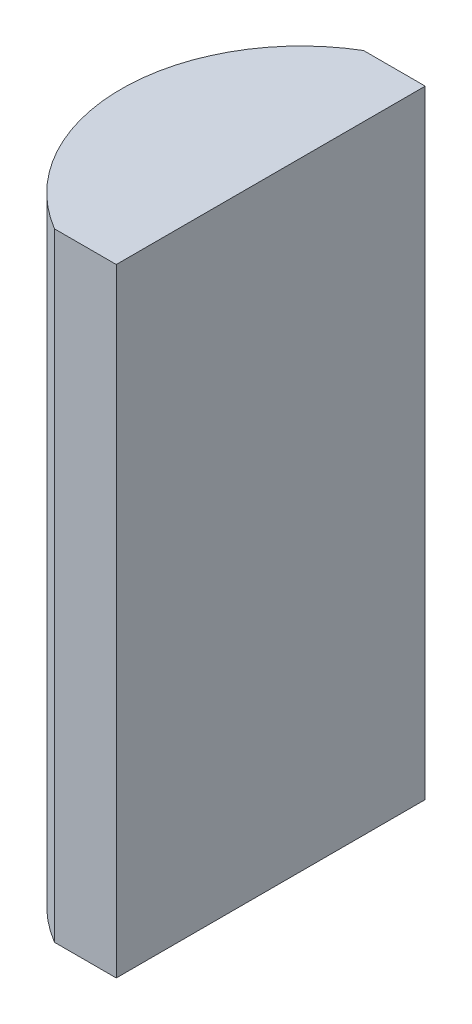
ISO-10303-21;
HEADER;
FILE_DESCRIPTION(('STEP AP214'),'2;1');
FILE_NAME('part.step','',(''),(''),'','','');
FILE_SCHEMA(('AUTOMOTIVE_DESIGN { 1 0 10303 214 1 1 1 1 }'));
ENDSEC;
DATA;
#1=APPLICATION_CONTEXT('core data for automotive mechanical design processes');
#2=APPLICATION_PROTOCOL_DEFINITION('international standard','automotive_design',2000,#1);
#3=PRODUCT_CONTEXT('',#1,'mechanical');
#4=PRODUCT('Part','Part','',(#3));
#5=PRODUCT_RELATED_PRODUCT_CATEGORY('part','',(#4));
#6=PRODUCT_DEFINITION_FORMATION('','',#4);
#7=PRODUCT_DEFINITION_CONTEXT('part definition',#1,'design');
#8=PRODUCT_DEFINITION('design','',#6,#7);
#9=PRODUCT_DEFINITION_SHAPE('','',#8);
#10=(LENGTH_UNIT() NAMED_UNIT(*) SI_UNIT(.MILLI.,.METRE.));
#11=(NAMED_UNIT(*) PLANE_ANGLE_UNIT() SI_UNIT($,.RADIAN.));
#12=(NAMED_UNIT(*) SI_UNIT($,.STERADIAN.) SOLID_ANGLE_UNIT());
#13=UNCERTAINTY_MEASURE_WITH_UNIT(LENGTH_MEASURE(1.E-05),#10,'distance_accuracy_value','');
#14=(GEOMETRIC_REPRESENTATION_CONTEXT(3) GLOBAL_UNCERTAINTY_ASSIGNED_CONTEXT((#13)) GLOBAL_UNIT_ASSIGNED_CONTEXT((#10,
#11,#12)) REPRESENTATION_CONTEXT('',''));
#15=CARTESIAN_POINT('',(0.,0.,0.));
#16=DIRECTION('',(0.,0.,1.));
#17=DIRECTION('',(1.,0.,0.));
#18=AXIS2_PLACEMENT_3D('',#15,#16,#17);
#19=CARTESIAN_POINT('',(4.35520433485127,20.,0.));
#20=DIRECTION('',(0.,-1.,0.));
#21=DIRECTION('',(0.,0.,-1.));
#22=AXIS2_PLACEMENT_3D('',#19,#20,#21);
#23=CYLINDRICAL_SURFACE('',#22,5.82);
#24=CARTESIAN_POINT('',(4.35520433485127,0.,0.));
#25=DIRECTION('',(0.,1.,0.));
#26=DIRECTION('',(0.,0.,1.));
#27=AXIS2_PLACEMENT_3D('',#24,#25,#26);
#28=CIRCLE('',#27,5.82);
#29=CARTESIAN_POINT('',(1.37654691916883,0.,-5.));
#30=VERTEX_POINT('',#29);
#31=CARTESIAN_POINT('',(1.37654691916883,0.,5.));
#32=VERTEX_POINT('',#31);
#33=EDGE_CURVE('E100',#30,#32,#28,.T.);
#34=ORIENTED_EDGE('',*,*,#33,.T.);
#35=DIRECTION('',(0.,-1.,0.));
#36=VECTOR('',#35,1.);
#37=CARTESIAN_POINT('',(1.37654691916883,20.,5.));
#38=LINE('',#37,#36);
#39=CARTESIAN_POINT('',(1.37654691916883,20.,5.));
#40=VERTEX_POINT('',#39);
#41=EDGE_CURVE('E11',#40,#32,#38,.T.);
#42=ORIENTED_EDGE('',*,*,#41,.F.);
#43=CARTESIAN_POINT('',(4.35520433485127,20.,0.));
#44=DIRECTION('',(0.,1.,0.));
#45=DIRECTION('',(0.,0.,1.));
#46=AXIS2_PLACEMENT_3D('',#43,#44,#45);
#47=CIRCLE('',#46,5.82);
#48=CARTESIAN_POINT('',(1.37654691916883,20.,-5.));
#49=VERTEX_POINT('',#48);
#50=EDGE_CURVE('E88',#49,#40,#47,.T.);
#51=ORIENTED_EDGE('',*,*,#50,.F.);
#52=DIRECTION('',(0.,-1.,0.));
#53=VECTOR('',#52,1.);
#54=CARTESIAN_POINT('',(1.37654691916883,20.,-5.));
#55=LINE('',#54,#53);
#56=EDGE_CURVE('E96',#49,#30,#55,.T.);
#57=ORIENTED_EDGE('',*,*,#56,.T.);
#58=EDGE_LOOP('',(#34,#42,#51,#57));
#59=FACE_BOUND('',#58,.T.);
#60=ADVANCED_FACE('F37',(#59),#23,.T.);
#61=CARTESIAN_POINT('',(1.37654691916883,20.,5.));
#62=DIRECTION('',(0.,0.,-1.));
#63=DIRECTION('',(-1.,0.,0.));
#64=AXIS2_PLACEMENT_3D('',#61,#62,#63);
#65=PLANE('',#64);
#66=DIRECTION('',(1.,0.,0.));
#67=VECTOR('',#66,1.);
#68=CARTESIAN_POINT('',(1.37654691916883,0.,5.));
#69=LINE('',#68,#67);
#70=CARTESIAN_POINT('',(3.37520433485128,0.,5.));
#71=VERTEX_POINT('',#70);
#72=EDGE_CURVE('E92',#32,#71,#69,.T.);
#73=ORIENTED_EDGE('',*,*,#72,.T.);
#74=DIRECTION('',(0.,-1.,0.));
#75=VECTOR('',#74,1.);
#76=CARTESIAN_POINT('',(3.37520433485128,20.,5.));
#77=LINE('',#76,#75);
#78=CARTESIAN_POINT('',(3.37520433485128,20.,5.));
#79=VERTEX_POINT('',#78);
#80=EDGE_CURVE('E45',#79,#71,#77,.T.);
#81=ORIENTED_EDGE('',*,*,#80,.F.);
#82=DIRECTION('',(1.,0.,0.));
#83=VECTOR('',#82,1.);
#84=CARTESIAN_POINT('',(1.37654691916883,20.,5.));
#85=LINE('',#84,#83);
#86=EDGE_CURVE('E83',#40,#79,#85,.T.);
#87=ORIENTED_EDGE('',*,*,#86,.F.);
#88=ORIENTED_EDGE('',*,*,#41,.T.);
#89=EDGE_LOOP('',(#73,#81,#87,#88));
#90=FACE_BOUND('',#89,.T.);
#91=ADVANCED_FACE('F91',(#90),#65,.F.);
#92=CARTESIAN_POINT('',(3.37520433485128,20.,-5.00000000000008));
#93=DIRECTION('',(-1.,0.,0.));
#94=DIRECTION('',(0.,0.,1.));
#95=AXIS2_PLACEMENT_3D('',#92,#93,#94);
#96=PLANE('',#95);
#97=DIRECTION('',(0.,0.,-1.));
#98=VECTOR('',#97,1.);
#99=CARTESIAN_POINT('',(3.37520433485128,0.,-5.00000000000008));
#100=LINE('',#99,#98);
#101=CARTESIAN_POINT('',(3.37520433485128,0.,-5.00000000000008));
#102=VERTEX_POINT('',#101);
#103=EDGE_CURVE('E70',#71,#102,#100,.T.);
#104=ORIENTED_EDGE('',*,*,#103,.T.);
#105=DIRECTION('',(0.,-1.,0.));
#106=VECTOR('',#105,1.);
#107=CARTESIAN_POINT('',(3.37520433485128,20.,-5.00000000000008));
#108=LINE('',#107,#106);
#109=CARTESIAN_POINT('',(3.37520433485128,20.,-5.00000000000008));
#110=VERTEX_POINT('',#109);
#111=EDGE_CURVE('E93',#110,#102,#108,.T.);
#112=ORIENTED_EDGE('',*,*,#111,.F.);
#113=DIRECTION('',(0.,0.,-1.));
#114=VECTOR('',#113,1.);
#115=CARTESIAN_POINT('',(3.37520433485128,20.,-5.00000000000008));
#116=LINE('',#115,#114);
#117=EDGE_CURVE('E86',#79,#110,#116,.T.);
#118=ORIENTED_EDGE('',*,*,#117,.F.);
#119=ORIENTED_EDGE('',*,*,#80,.T.);
#120=EDGE_LOOP('',(#104,#112,#118,#119));
#121=FACE_BOUND('',#120,.T.);
#122=ADVANCED_FACE('F94',(#121),#96,.F.);
#123=CARTESIAN_POINT('',(1.37654691916883,20.,-5.));
#124=DIRECTION('',(0.,0.,1.));
#125=DIRECTION('',(1.,0.,0.));
#126=AXIS2_PLACEMENT_3D('',#123,#124,#125);
#127=PLANE('',#126);
#128=DIRECTION('',(-1.,0.,0.));
#129=VECTOR('',#128,1.);
#130=CARTESIAN_POINT('',(1.37654691916883,0.,-5.));
#131=LINE('',#130,#129);
#132=EDGE_CURVE('E76',#102,#30,#131,.T.);
#133=ORIENTED_EDGE('',*,*,#132,.T.);
#134=ORIENTED_EDGE('',*,*,#56,.F.);
#135=DIRECTION('',(-1.,0.,0.));
#136=VECTOR('',#135,1.);
#137=CARTESIAN_POINT('',(1.37654691916883,20.,-5.));
#138=LINE('',#137,#136);
#139=EDGE_CURVE('E53',#110,#49,#138,.T.);
#140=ORIENTED_EDGE('',*,*,#139,.F.);
#141=ORIENTED_EDGE('',*,*,#111,.T.);
#142=EDGE_LOOP('',(#133,#134,#140,#141));
#143=FACE_BOUND('',#142,.T.);
#144=ADVANCED_FACE('F107',(#143),#127,.F.);
#145=CARTESIAN_POINT('',(4.35520433485127,20.,0.));
#146=DIRECTION('',(0.,1.,0.));
#147=DIRECTION('',(0.,0.,1.));
#148=AXIS2_PLACEMENT_3D('',#145,#146,#147);
#149=PLANE('',#148);
#150=ORIENTED_EDGE('',*,*,#50,.T.);
#151=ORIENTED_EDGE('',*,*,#86,.T.);
#152=ORIENTED_EDGE('',*,*,#117,.T.);
#153=ORIENTED_EDGE('',*,*,#139,.T.);
#154=EDGE_LOOP('',(#150,#151,#152,#153));
#155=FACE_BOUND('',#154,.T.);
#156=ADVANCED_FACE('F84',(#155),#149,.T.);
#157=CARTESIAN_POINT('',(4.35520433485127,0.,0.));
#158=DIRECTION('',(0.,1.,0.));
#159=DIRECTION('',(0.,0.,1.));
#160=AXIS2_PLACEMENT_3D('',#157,#158,#159);
#161=PLANE('',#160);
#162=ORIENTED_EDGE('',*,*,#33,.F.);
#163=ORIENTED_EDGE('',*,*,#132,.F.);
#164=ORIENTED_EDGE('',*,*,#103,.F.);
#165=ORIENTED_EDGE('',*,*,#72,.F.);
#166=EDGE_LOOP('',(#162,#163,#164,#165));
#167=FACE_BOUND('',#166,.T.);
#168=ADVANCED_FACE('F110',(#167),#161,.F.);
#169=CLOSED_SHELL('',(#60,#91,#122,#144,#156,#168));
#170=MANIFOLD_SOLID_BREP('B2',#169);
#171=ADVANCED_BREP_SHAPE_REPRESENTATION('',(#18,#170),#14);
#172=SHAPE_DEFINITION_REPRESENTATION(#9,#171);
ENDSEC;
END-ISO-10303-21;
